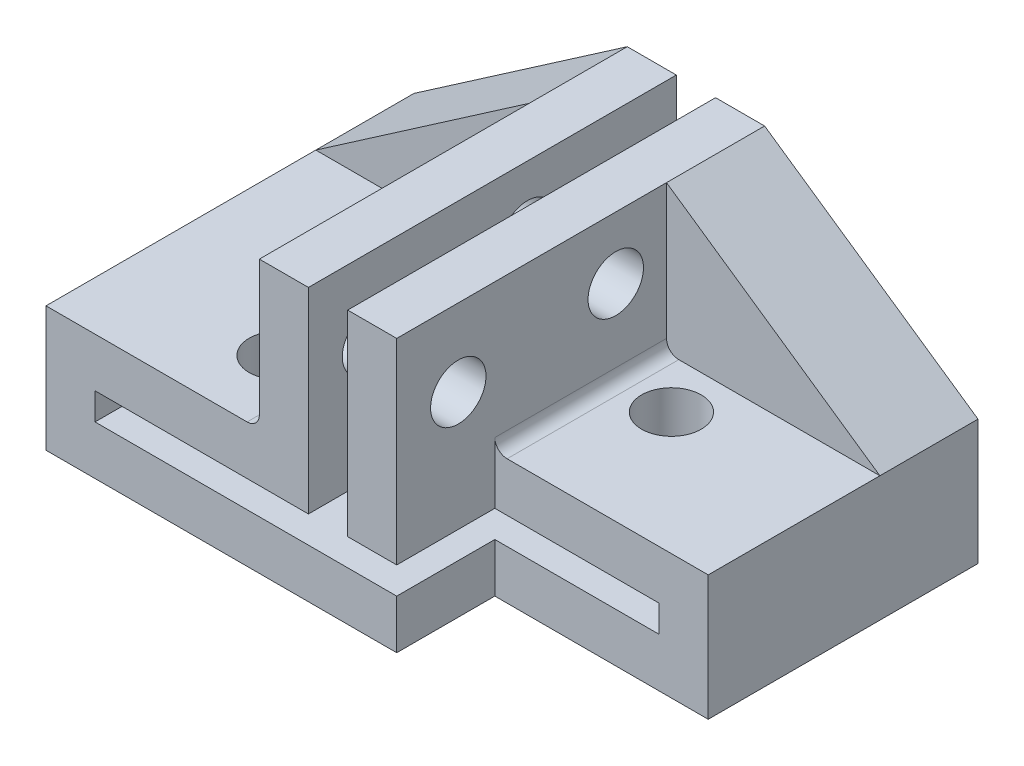
ISO-10303-21;
HEADER;
FILE_DESCRIPTION(('STEP AP214'),'2;1');
FILE_NAME('part.step','',(''),(''),'','','');
FILE_SCHEMA(('AUTOMOTIVE_DESIGN { 1 0 10303 214 1 1 1 1 }'));
ENDSEC;
DATA;
#1=APPLICATION_CONTEXT('core data for automotive mechanical design processes');
#2=APPLICATION_PROTOCOL_DEFINITION('international standard','automotive_design',2000,#1);
#3=PRODUCT_CONTEXT('',#1,'mechanical');
#4=PRODUCT('Part','Part','',(#3));
#5=PRODUCT_RELATED_PRODUCT_CATEGORY('part','',(#4));
#6=PRODUCT_DEFINITION_FORMATION('','',#4);
#7=PRODUCT_DEFINITION_CONTEXT('part definition',#1,'design');
#8=PRODUCT_DEFINITION('design','',#6,#7);
#9=PRODUCT_DEFINITION_SHAPE('','',#8);
#10=(LENGTH_UNIT() NAMED_UNIT(*) SI_UNIT(.MILLI.,.METRE.));
#11=(NAMED_UNIT(*) PLANE_ANGLE_UNIT() SI_UNIT($,.RADIAN.));
#12=(NAMED_UNIT(*) SI_UNIT($,.STERADIAN.) SOLID_ANGLE_UNIT());
#13=UNCERTAINTY_MEASURE_WITH_UNIT(LENGTH_MEASURE(1.E-05),#10,'distance_accuracy_value','');
#14=(GEOMETRIC_REPRESENTATION_CONTEXT(3) GLOBAL_UNCERTAINTY_ASSIGNED_CONTEXT((#13)) GLOBAL_UNIT_ASSIGNED_CONTEXT((#10,
#11,#12)) REPRESENTATION_CONTEXT('',''));
#15=CARTESIAN_POINT('',(0.,0.,0.));
#16=DIRECTION('',(0.,0.,1.));
#17=DIRECTION('',(1.,0.,0.));
#18=AXIS2_PLACEMENT_3D('',#15,#16,#17);
#19=CARTESIAN_POINT('',(14.3,-6.,15.));
#20=DIRECTION('',(0.,-1.,0.));
#21=DIRECTION('',(0.,0.,-1.));
#22=AXIS2_PLACEMENT_3D('',#19,#20,#21);
#23=PLANE('',#22);
#24=CARTESIAN_POINT('',(7.8,-6.,6.));
#25=DIRECTION('',(0.,1.,0.));
#26=DIRECTION('',(0.,0.,1.));
#27=AXIS2_PLACEMENT_3D('',#24,#25,#26);
#28=CIRCLE('',#27,1.215);
#29=CARTESIAN_POINT('',(7.8,-6.,7.215));
#30=VERTEX_POINT('',#29);
#31=EDGE_CURVE('E247',#30,#30,#28,.T.);
#32=ORIENTED_EDGE('',*,*,#31,.F.);
#33=EDGE_LOOP('',(#32));
#34=FACE_BOUND('',#33,.T.);
#35=DIRECTION('',(1.,0.,0.));
#36=VECTOR('',#35,1.);
#37=CARTESIAN_POINT('',(5.6,-6.,4.));
#38=LINE('',#37,#36);
#39=CARTESIAN_POINT('',(6.1,-6.,4.));
#40=VERTEX_POINT('',#39);
#41=CARTESIAN_POINT('',(14.3,-6.,4.));
#42=VERTEX_POINT('',#41);
#43=EDGE_CURVE('E449',#40,#42,#38,.T.);
#44=ORIENTED_EDGE('',*,*,#43,.F.);
#45=DIRECTION('',(0.,0.,-1.));
#46=VECTOR('',#45,1.);
#47=CARTESIAN_POINT('',(6.1,-6.,11.));
#48=LINE('',#47,#46);
#49=CARTESIAN_POINT('',(6.1,-6.,11.));
#50=VERTEX_POINT('',#49);
#51=EDGE_CURVE('E418',#40,#50,#48,.F.);
#52=ORIENTED_EDGE('',*,*,#51,.T.);
#53=DIRECTION('',(-1.,0.,0.));
#54=VECTOR('',#53,1.);
#55=CARTESIAN_POINT('',(14.3,-6.,11.));
#56=LINE('',#55,#54);
#57=CARTESIAN_POINT('',(14.3,-6.,11.));
#58=VERTEX_POINT('',#57);
#59=EDGE_CURVE('E287',#58,#50,#56,.T.);
#60=ORIENTED_EDGE('',*,*,#59,.F.);
#61=DIRECTION('',(0.,0.,-1.));
#62=VECTOR('',#61,1.);
#63=CARTESIAN_POINT('',(14.3,-6.,15.));
#64=LINE('',#63,#62);
#65=EDGE_CURVE('E388',#58,#42,#64,.T.);
#66=ORIENTED_EDGE('',*,*,#65,.T.);
#67=EDGE_LOOP('',(#44,#52,#60,#66));
#68=FACE_BOUND('',#67,.T.);
#69=ADVANCED_FACE('F39',(#34,#68),#23,.F.);
#70=CARTESIAN_POINT('',(5.6,-6.,15.));
#71=DIRECTION('',(-1.,0.,0.));
#72=DIRECTION('',(0.,-1.,0.));
#73=AXIS2_PLACEMENT_3D('',#70,#71,#72);
#74=PLANE('',#73);
#75=CARTESIAN_POINT('',(5.6,-2.53,6.06969452053169));
#76=DIRECTION('',(-1.,0.,0.));
#77=DIRECTION('',(0.,-1.,0.));
#78=AXIS2_PLACEMENT_3D('',#75,#76,#77);
#79=CIRCLE('',#78,1.1303);
#80=CARTESIAN_POINT('',(5.6,-3.6603,6.06969452053169));
#81=VERTEX_POINT('',#80);
#82=EDGE_CURVE('E284',#81,#81,#79,.T.);
#83=ORIENTED_EDGE('',*,*,#82,.T.);
#84=EDGE_LOOP('',(#83));
#85=FACE_BOUND('',#84,.T.);
#86=CARTESIAN_POINT('',(5.6,-3.1482051037554,12.49));
#87=DIRECTION('',(-1.,0.,0.));
#88=DIRECTION('',(0.,-1.,0.));
#89=AXIS2_PLACEMENT_3D('',#86,#87,#88);
#90=CIRCLE('',#89,1.1303);
#91=CARTESIAN_POINT('',(5.6,-4.2785051037554,12.49));
#92=VERTEX_POINT('',#91);
#93=EDGE_CURVE('E274',#92,#92,#90,.T.);
#94=ORIENTED_EDGE('',*,*,#93,.T.);
#95=EDGE_LOOP('',(#94));
#96=FACE_BOUND('',#95,.T.);
#97=DIRECTION('',(0.,1.,0.));
#98=VECTOR('',#97,1.);
#99=CARTESIAN_POINT('',(5.6,-21.,11.));
#100=LINE('',#99,#98);
#101=CARTESIAN_POINT('',(5.6,-8.,11.));
#102=VERTEX_POINT('',#101);
#103=CARTESIAN_POINT('',(5.6,-5.5,11.));
#104=VERTEX_POINT('',#103);
#105=EDGE_CURVE('E291',#102,#104,#100,.T.);
#106=ORIENTED_EDGE('',*,*,#105,.T.);
#107=DIRECTION('',(0.,0.,-1.));
#108=VECTOR('',#107,1.);
#109=CARTESIAN_POINT('',(5.6,-5.5,4.));
#110=LINE('',#109,#108);
#111=CARTESIAN_POINT('',(5.6,-5.5,4.));
#112=VERTEX_POINT('',#111);
#113=EDGE_CURVE('E403',#104,#112,#110,.T.);
#114=ORIENTED_EDGE('',*,*,#113,.T.);
#115=DIRECTION('',(0.,-1.,0.));
#116=VECTOR('',#115,1.);
#117=CARTESIAN_POINT('',(5.6,0.,4.));
#118=LINE('',#117,#116);
#119=CARTESIAN_POINT('',(5.6,0.,4.));
#120=VERTEX_POINT('',#119);
#121=EDGE_CURVE('E439',#120,#112,#118,.T.);
#122=ORIENTED_EDGE('',*,*,#121,.F.);
#123=DIRECTION('',(0.,0.,-1.));
#124=VECTOR('',#123,1.);
#125=CARTESIAN_POINT('',(5.6,0.,15.));
#126=LINE('',#125,#124);
#127=CARTESIAN_POINT('',(5.6,0.,15.));
#128=VERTEX_POINT('',#127);
#129=EDGE_CURVE('E385',#128,#120,#126,.T.);
#130=ORIENTED_EDGE('',*,*,#129,.F.);
#131=DIRECTION('',(0.,1.,0.));
#132=VECTOR('',#131,1.);
#133=CARTESIAN_POINT('',(5.6,-6.,15.));
#134=LINE('',#133,#132);
#135=CARTESIAN_POINT('',(5.6,-8.,15.));
#136=VERTEX_POINT('',#135);
#137=EDGE_CURVE('E322',#136,#128,#134,.T.);
#138=ORIENTED_EDGE('',*,*,#137,.F.);
#139=DIRECTION('',(0.,0.,-1.));
#140=VECTOR('',#139,1.);
#141=CARTESIAN_POINT('',(5.6,-8.,15.));
#142=LINE('',#141,#140);
#143=EDGE_CURVE('E297',#136,#102,#142,.T.);
#144=ORIENTED_EDGE('',*,*,#143,.T.);
#145=EDGE_LOOP('',(#106,#114,#122,#130,#138,#144));
#146=FACE_BOUND('',#145,.T.);
#147=ADVANCED_FACE('F437',(#85,#96,#146),#74,.F.);
#148=CARTESIAN_POINT('',(0.,0.,15.));
#149=DIRECTION('',(1.,0.,0.));
#150=DIRECTION('',(0.,1.,0.));
#151=AXIS2_PLACEMENT_3D('',#148,#149,#150);
#152=PLANE('',#151);
#153=CARTESIAN_POINT('',(0.,-2.53,6.06969452053169));
#154=DIRECTION('',(-1.,0.,0.));
#155=DIRECTION('',(0.,-1.,0.));
#156=AXIS2_PLACEMENT_3D('',#153,#154,#155);
#157=CIRCLE('',#156,1.1303);
#158=CARTESIAN_POINT('',(0.,-3.6603,6.06969452053169));
#159=VERTEX_POINT('',#158);
#160=EDGE_CURVE('E277',#159,#159,#157,.T.);
#161=ORIENTED_EDGE('',*,*,#160,.F.);
#162=EDGE_LOOP('',(#161));
#163=FACE_BOUND('',#162,.T.);
#164=CARTESIAN_POINT('',(0.,-3.1482051037554,12.49));
#165=DIRECTION('',(-1.,0.,0.));
#166=DIRECTION('',(0.,-1.,0.));
#167=AXIS2_PLACEMENT_3D('',#164,#165,#166);
#168=CIRCLE('',#167,1.1303);
#169=CARTESIAN_POINT('',(0.,-4.2785051037554,12.49));
#170=VERTEX_POINT('',#169);
#171=EDGE_CURVE('E267',#170,#170,#168,.T.);
#172=ORIENTED_EDGE('',*,*,#171,.F.);
#173=EDGE_LOOP('',(#172));
#174=FACE_BOUND('',#173,.T.);
#175=DIRECTION('',(0.,-1.,0.));
#176=VECTOR('',#175,1.);
#177=CARTESIAN_POINT('',(0.,0.,4.));
#178=LINE('',#177,#176);
#179=CARTESIAN_POINT('',(0.,0.,4.));
#180=VERTEX_POINT('',#179);
#181=CARTESIAN_POINT('',(0.,-5.5,4.));
#182=VERTEX_POINT('',#181);
#183=EDGE_CURVE('E224',#180,#182,#178,.T.);
#184=ORIENTED_EDGE('',*,*,#183,.T.);
#185=DIRECTION('',(0.,0.,-1.));
#186=VECTOR('',#185,1.);
#187=CARTESIAN_POINT('',(0.,-5.5,15.));
#188=LINE('',#187,#186);
#189=CARTESIAN_POINT('',(0.,-5.5,15.));
#190=VERTEX_POINT('',#189);
#191=EDGE_CURVE('E54',#182,#190,#188,.F.);
#192=ORIENTED_EDGE('',*,*,#191,.T.);
#193=DIRECTION('',(0.,-1.,0.));
#194=VECTOR('',#193,1.);
#195=CARTESIAN_POINT('',(0.,0.,15.));
#196=LINE('',#195,#194);
#197=CARTESIAN_POINT('',(0.,0.,15.));
#198=VERTEX_POINT('',#197);
#199=EDGE_CURVE('E312',#198,#190,#196,.T.);
#200=ORIENTED_EDGE('',*,*,#199,.F.);
#201=DIRECTION('',(0.,0.,-1.));
#202=VECTOR('',#201,1.);
#203=CARTESIAN_POINT('',(0.,0.,15.));
#204=LINE('',#203,#202);
#205=EDGE_CURVE('E396',#198,#180,#204,.T.);
#206=ORIENTED_EDGE('',*,*,#205,.T.);
#207=EDGE_LOOP('',(#184,#192,#200,#206));
#208=FACE_BOUND('',#207,.T.);
#209=ADVANCED_FACE('F474',(#163,#174,#208),#152,.F.);
#210=CARTESIAN_POINT('',(0.,-6.,15.));
#211=DIRECTION('',(0.,-1.,0.));
#212=DIRECTION('',(1.,0.,0.));
#213=AXIS2_PLACEMENT_3D('',#210,#211,#212);
#214=PLANE('',#213);
#215=CARTESIAN_POINT('',(-2.2,-6.,12.));
#216=DIRECTION('',(0.,1.,0.));
#217=DIRECTION('',(0.,0.,1.));
#218=AXIS2_PLACEMENT_3D('',#215,#216,#217);
#219=CIRCLE('',#218,1.215);
#220=CARTESIAN_POINT('',(-2.2,-6.,13.215));
#221=VERTEX_POINT('',#220);
#222=EDGE_CURVE('E257',#221,#221,#219,.T.);
#223=ORIENTED_EDGE('',*,*,#222,.F.);
#224=EDGE_LOOP('',(#223));
#225=FACE_BOUND('',#224,.T.);
#226=CARTESIAN_POINT('',(-2.2,-6.,6.));
#227=DIRECTION('',(0.,1.,0.));
#228=DIRECTION('',(0.,0.,1.));
#229=AXIS2_PLACEMENT_3D('',#226,#227,#228);
#230=CIRCLE('',#229,1.215);
#231=CARTESIAN_POINT('',(-2.2,-6.,7.215));
#232=VERTEX_POINT('',#231);
#233=EDGE_CURVE('E236',#232,#232,#230,.T.);
#234=ORIENTED_EDGE('',*,*,#233,.F.);
#235=EDGE_LOOP('',(#234));
#236=FACE_BOUND('',#235,.T.);
#237=DIRECTION('',(-1.,0.,0.));
#238=VECTOR('',#237,1.);
#239=CARTESIAN_POINT('',(0.,-6.,15.));
#240=LINE('',#239,#238);
#241=CARTESIAN_POINT('',(-0.499999999999999,-6.,15.));
#242=VERTEX_POINT('',#241);
#243=CARTESIAN_POINT('',(-8.7,-6.,15.));
#244=VERTEX_POINT('',#243);
#245=EDGE_CURVE('E315',#242,#244,#240,.T.);
#246=ORIENTED_EDGE('',*,*,#245,.F.);
#247=DIRECTION('',(0.,0.,-1.));
#248=VECTOR('',#247,1.);
#249=CARTESIAN_POINT('',(-0.499999999999999,-6.,4.));
#250=LINE('',#249,#248);
#251=CARTESIAN_POINT('',(-0.499999999999999,-6.,4.));
#252=VERTEX_POINT('',#251);
#253=EDGE_CURVE('E420',#242,#252,#250,.T.);
#254=ORIENTED_EDGE('',*,*,#253,.T.);
#255=DIRECTION('',(-1.,0.,0.));
#256=VECTOR('',#255,1.);
#257=CARTESIAN_POINT('',(0.,-6.,4.));
#258=LINE('',#257,#256);
#259=CARTESIAN_POINT('',(-8.7,-6.,4.));
#260=VERTEX_POINT('',#259);
#261=EDGE_CURVE('E227',#252,#260,#258,.T.);
#262=ORIENTED_EDGE('',*,*,#261,.T.);
#263=DIRECTION('',(0.,0.,-1.));
#264=VECTOR('',#263,1.);
#265=CARTESIAN_POINT('',(-8.7,-6.,15.));
#266=LINE('',#265,#264);
#267=EDGE_CURVE('E215',#244,#260,#266,.T.);
#268=ORIENTED_EDGE('',*,*,#267,.F.);
#269=EDGE_LOOP('',(#246,#254,#262,#268));
#270=FACE_BOUND('',#269,.T.);
#271=ADVANCED_FACE('F489',(#225,#236,#270),#214,.F.);
#272=CARTESIAN_POINT('',(0.,0.,15.));
#273=DIRECTION('',(0.,0.,1.));
#274=DIRECTION('',(1.,0.,0.));
#275=AXIS2_PLACEMENT_3D('',#272,#273,#274);
#276=PLANE('',#275);
#277=DIRECTION('',(-1.,0.,0.));
#278=VECTOR('',#277,1.);
#279=CARTESIAN_POINT('',(12.3,-8.,15.));
#280=LINE('',#279,#278);
#281=CARTESIAN_POINT('',(3.6,-8.,15.));
#282=VERTEX_POINT('',#281);
#283=EDGE_CURVE('E329',#136,#282,#280,.T.);
#284=ORIENTED_EDGE('',*,*,#283,.F.);
#285=ORIENTED_EDGE('',*,*,#137,.T.);
#286=DIRECTION('',(-1.,0.,0.));
#287=VECTOR('',#286,1.);
#288=CARTESIAN_POINT('',(5.6,0.,15.));
#289=LINE('',#288,#287);
#290=CARTESIAN_POINT('',(3.6,0.,15.));
#291=VERTEX_POINT('',#290);
#292=EDGE_CURVE('E324',#128,#291,#289,.T.);
#293=ORIENTED_EDGE('',*,*,#292,.T.);
#294=DIRECTION('',(0.,1.,0.));
#295=VECTOR('',#294,1.);
#296=CARTESIAN_POINT('',(3.6,-3.54106484325997,15.));
#297=LINE('',#296,#295);
#298=EDGE_CURVE('E326',#282,#291,#297,.T.);
#299=ORIENTED_EDGE('',*,*,#298,.F.);
#300=EDGE_LOOP('',(#284,#285,#293,#299));
#301=FACE_BOUND('',#300,.T.);
#302=ADVANCED_FACE('F492',(#301),#276,.T.);
#303=CARTESIAN_POINT('',(2.,0.,15.));
#304=DIRECTION('',(0.,-1.,0.));
#305=DIRECTION('',(1.,0.,0.));
#306=AXIS2_PLACEMENT_3D('',#303,#304,#305);
#307=PLANE('',#306);
#308=DIRECTION('',(-1.,0.,0.));
#309=VECTOR('',#308,1.);
#310=CARTESIAN_POINT('',(2.,0.,0.));
#311=LINE('',#310,#309);
#312=CARTESIAN_POINT('',(2.,0.,0.));
#313=VERTEX_POINT('',#312);
#314=CARTESIAN_POINT('',(0.,0.,0.));
#315=VERTEX_POINT('',#314);
#316=EDGE_CURVE('E207',#313,#315,#311,.T.);
#317=ORIENTED_EDGE('',*,*,#316,.T.);
#318=DIRECTION('',(0.,0.,-1.));
#319=VECTOR('',#318,1.);
#320=CARTESIAN_POINT('',(0.,0.,4.));
#321=LINE('',#320,#319);
#322=EDGE_CURVE('E219',#180,#315,#321,.T.);
#323=ORIENTED_EDGE('',*,*,#322,.F.);
#324=ORIENTED_EDGE('',*,*,#205,.F.);
#325=DIRECTION('',(-1.,0.,0.));
#326=VECTOR('',#325,1.);
#327=CARTESIAN_POINT('',(2.,0.,15.));
#328=LINE('',#327,#326);
#329=CARTESIAN_POINT('',(2.,0.,15.));
#330=VERTEX_POINT('',#329);
#331=EDGE_CURVE('E309',#330,#198,#328,.T.);
#332=ORIENTED_EDGE('',*,*,#331,.F.);
#333=DIRECTION('',(0.,0.,-1.));
#334=VECTOR('',#333,1.);
#335=CARTESIAN_POINT('',(2.,0.,15.));
#336=LINE('',#335,#334);
#337=EDGE_CURVE('E342',#330,#313,#336,.T.);
#338=ORIENTED_EDGE('',*,*,#337,.T.);
#339=EDGE_LOOP('',(#317,#323,#324,#332,#338));
#340=FACE_BOUND('',#339,.T.);
#341=ADVANCED_FACE('F488',(#340),#307,.F.);
#342=CARTESIAN_POINT('',(-8.7,-6.,15.));
#343=DIRECTION('',(1.,0.,0.));
#344=DIRECTION('',(0.,0.,-1.));
#345=AXIS2_PLACEMENT_3D('',#342,#343,#344);
#346=PLANE('',#345);
#347=DIRECTION('',(0.,-1.,0.));
#348=VECTOR('',#347,1.);
#349=CARTESIAN_POINT('',(-8.7,-6.,0.));
#350=LINE('',#349,#348);
#351=CARTESIAN_POINT('',(-8.7,-6.,0.));
#352=VERTEX_POINT('',#351);
#353=CARTESIAN_POINT('',(-8.7,-11.1,0.));
#354=VERTEX_POINT('',#353);
#355=EDGE_CURVE('E194',#352,#354,#350,.T.);
#356=ORIENTED_EDGE('',*,*,#355,.T.);
#357=DIRECTION('',(0.,0.,-1.));
#358=VECTOR('',#357,1.);
#359=CARTESIAN_POINT('',(-8.7,-11.1,15.));
#360=LINE('',#359,#358);
#361=CARTESIAN_POINT('',(-8.7,-11.1,15.));
#362=VERTEX_POINT('',#361);
#363=EDGE_CURVE('E393',#362,#354,#360,.T.);
#364=ORIENTED_EDGE('',*,*,#363,.F.);
#365=DIRECTION('',(0.,-1.,0.));
#366=VECTOR('',#365,1.);
#367=CARTESIAN_POINT('',(-8.7,-6.,15.));
#368=LINE('',#367,#366);
#369=EDGE_CURVE('E317',#244,#362,#368,.T.);
#370=ORIENTED_EDGE('',*,*,#369,.F.);
#371=ORIENTED_EDGE('',*,*,#267,.T.);
#372=DIRECTION('',(0.,0.,-1.));
#373=VECTOR('',#372,1.);
#374=CARTESIAN_POINT('',(-8.7,-6.,4.));
#375=LINE('',#374,#373);
#376=EDGE_CURVE('E211',#260,#352,#375,.T.);
#377=ORIENTED_EDGE('',*,*,#376,.T.);
#378=EDGE_LOOP('',(#356,#364,#370,#371,#377));
#379=FACE_BOUND('',#378,.T.);
#380=ADVANCED_FACE('F212',(#379),#346,.F.);
#381=CARTESIAN_POINT('',(-8.7,-11.1,15.));
#382=DIRECTION('',(0.,1.,0.));
#383=DIRECTION('',(0.,0.,1.));
#384=AXIS2_PLACEMENT_3D('',#381,#382,#383);
#385=PLANE('',#384);
#386=CARTESIAN_POINT('',(-2.2,-11.1,6.));
#387=DIRECTION('',(0.,1.,0.));
#388=DIRECTION('',(0.,0.,1.));
#389=AXIS2_PLACEMENT_3D('',#386,#387,#388);
#390=CIRCLE('',#389,1.215);
#391=CARTESIAN_POINT('',(-2.2,-11.1,7.215));
#392=VERTEX_POINT('',#391);
#393=EDGE_CURVE('E244',#392,#392,#390,.T.);
#394=ORIENTED_EDGE('',*,*,#393,.T.);
#395=EDGE_LOOP('',(#394));
#396=FACE_BOUND('',#395,.T.);
#397=CARTESIAN_POINT('',(7.8,-11.1,6.));
#398=DIRECTION('',(0.,1.,0.));
#399=DIRECTION('',(0.,0.,1.));
#400=AXIS2_PLACEMENT_3D('',#397,#398,#399);
#401=CIRCLE('',#400,1.215);
#402=CARTESIAN_POINT('',(7.8,-11.1,7.215));
#403=VERTEX_POINT('',#402);
#404=EDGE_CURVE('E254',#403,#403,#401,.T.);
#405=ORIENTED_EDGE('',*,*,#404,.T.);
#406=EDGE_LOOP('',(#405));
#407=FACE_BOUND('',#406,.T.);
#408=CARTESIAN_POINT('',(-2.2,-11.1,12.));
#409=DIRECTION('',(0.,1.,0.));
#410=DIRECTION('',(0.,0.,1.));
#411=AXIS2_PLACEMENT_3D('',#408,#409,#410);
#412=CIRCLE('',#411,1.215);
#413=CARTESIAN_POINT('',(-2.2,-11.1,13.215));
#414=VERTEX_POINT('',#413);
#415=EDGE_CURVE('E264',#414,#414,#412,.T.);
#416=ORIENTED_EDGE('',*,*,#415,.T.);
#417=EDGE_LOOP('',(#416));
#418=FACE_BOUND('',#417,.T.);
#419=DIRECTION('',(-1.,0.,0.));
#420=VECTOR('',#419,1.);
#421=CARTESIAN_POINT('',(-8.7,-11.1,11.));
#422=LINE('',#421,#420);
#423=CARTESIAN_POINT('',(14.3,-11.1,11.));
#424=VERTEX_POINT('',#423);
#425=CARTESIAN_POINT('',(5.6,-11.1,11.));
#426=VERTEX_POINT('',#425);
#427=EDGE_CURVE('E306',#424,#426,#422,.T.);
#428=ORIENTED_EDGE('',*,*,#427,.T.);
#429=DIRECTION('',(0.,0.,1.));
#430=VECTOR('',#429,1.);
#431=CARTESIAN_POINT('',(5.6,-11.1,15.));
#432=LINE('',#431,#430);
#433=CARTESIAN_POINT('',(5.6,-11.1,15.));
#434=VERTEX_POINT('',#433);
#435=EDGE_CURVE('E299',#426,#434,#432,.T.);
#436=ORIENTED_EDGE('',*,*,#435,.T.);
#437=DIRECTION('',(1.,0.,0.));
#438=VECTOR('',#437,1.);
#439=CARTESIAN_POINT('',(-8.7,-11.1,15.));
#440=LINE('',#439,#438);
#441=EDGE_CURVE('E319',#362,#434,#440,.T.);
#442=ORIENTED_EDGE('',*,*,#441,.F.);
#443=ORIENTED_EDGE('',*,*,#363,.T.);
#444=DIRECTION('',(1.,0.,0.));
#445=VECTOR('',#444,1.);
#446=CARTESIAN_POINT('',(-8.7,-11.1,0.));
#447=LINE('',#446,#445);
#448=CARTESIAN_POINT('',(14.3,-11.1,0.));
#449=VERTEX_POINT('',#448);
#450=EDGE_CURVE('E203',#354,#449,#447,.T.);
#451=ORIENTED_EDGE('',*,*,#450,.T.);
#452=DIRECTION('',(0.,0.,-1.));
#453=VECTOR('',#452,1.);
#454=CARTESIAN_POINT('',(14.3,-11.1,15.));
#455=LINE('',#454,#453);
#456=EDGE_CURVE('E391',#424,#449,#455,.T.);
#457=ORIENTED_EDGE('',*,*,#456,.F.);
#458=EDGE_LOOP('',(#428,#436,#442,#443,#451,#457));
#459=FACE_BOUND('',#458,.T.);
#460=ADVANCED_FACE('F482',(#396,#407,#418,#459),#385,.F.);
#461=CARTESIAN_POINT('',(14.3,-11.1,15.));
#462=DIRECTION('',(-1.,0.,0.));
#463=DIRECTION('',(0.,0.,1.));
#464=AXIS2_PLACEMENT_3D('',#461,#462,#463);
#465=PLANE('',#464);
#466=ORIENTED_EDGE('',*,*,#65,.F.);
#467=DIRECTION('',(0.,1.,0.));
#468=VECTOR('',#467,1.);
#469=CARTESIAN_POINT('',(14.3,-21.,11.));
#470=LINE('',#469,#468);
#471=EDGE_CURVE('E290',#424,#58,#470,.T.);
#472=ORIENTED_EDGE('',*,*,#471,.F.);
#473=ORIENTED_EDGE('',*,*,#456,.T.);
#474=DIRECTION('',(0.,1.,0.));
#475=VECTOR('',#474,1.);
#476=CARTESIAN_POINT('',(14.3,-11.1,0.));
#477=LINE('',#476,#475);
#478=CARTESIAN_POINT('',(14.3,-6.,0.));
#479=VERTEX_POINT('',#478);
#480=EDGE_CURVE('E345',#449,#479,#477,.T.);
#481=ORIENTED_EDGE('',*,*,#480,.T.);
#482=DIRECTION('',(0.,0.,-1.));
#483=VECTOR('',#482,1.);
#484=CARTESIAN_POINT('',(14.3,-6.00000000000001,4.));
#485=LINE('',#484,#483);
#486=EDGE_CURVE('E225',#42,#479,#485,.T.);
#487=ORIENTED_EDGE('',*,*,#486,.F.);
#488=EDGE_LOOP('',(#466,#472,#473,#481,#487));
#489=FACE_BOUND('',#488,.T.);
#490=ADVANCED_FACE('F465',(#489),#465,.F.);
#491=CARTESIAN_POINT('',(5.6,0.,15.));
#492=DIRECTION('',(0.,-1.,0.));
#493=DIRECTION('',(1.,0.,0.));
#494=AXIS2_PLACEMENT_3D('',#491,#492,#493);
#495=PLANE('',#494);
#496=DIRECTION('',(-1.,0.,0.));
#497=VECTOR('',#496,1.);
#498=CARTESIAN_POINT('',(5.6,0.,0.));
#499=LINE('',#498,#497);
#500=CARTESIAN_POINT('',(5.6,0.,0.));
#501=VERTEX_POINT('',#500);
#502=CARTESIAN_POINT('',(3.6,0.,0.));
#503=VERTEX_POINT('',#502);
#504=EDGE_CURVE('E347',#501,#503,#499,.T.);
#505=ORIENTED_EDGE('',*,*,#504,.T.);
#506=DIRECTION('',(0.,0.,-1.));
#507=VECTOR('',#506,1.);
#508=CARTESIAN_POINT('',(3.6,0.,15.));
#509=LINE('',#508,#507);
#510=EDGE_CURVE('E382',#291,#503,#509,.T.);
#511=ORIENTED_EDGE('',*,*,#510,.F.);
#512=ORIENTED_EDGE('',*,*,#292,.F.);
#513=ORIENTED_EDGE('',*,*,#129,.T.);
#514=DIRECTION('',(0.,0.,-1.));
#515=VECTOR('',#514,1.);
#516=CARTESIAN_POINT('',(5.6,0.,4.));
#517=LINE('',#516,#515);
#518=EDGE_CURVE('E230',#120,#501,#517,.T.);
#519=ORIENTED_EDGE('',*,*,#518,.T.);
#520=EDGE_LOOP('',(#505,#511,#512,#513,#519));
#521=FACE_BOUND('',#520,.T.);
#522=ADVANCED_FACE('F456',(#521),#495,.F.);
#523=CARTESIAN_POINT('',(3.6,-8.,15.));
#524=DIRECTION('',(-1.,0.,0.));
#525=DIRECTION('',(0.,0.,1.));
#526=AXIS2_PLACEMENT_3D('',#523,#524,#525);
#527=PLANE('',#526);
#528=CARTESIAN_POINT('',(3.6,-3.1482051037554,12.49));
#529=DIRECTION('',(-1.,0.,0.));
#530=DIRECTION('',(0.,0.,1.));
#531=AXIS2_PLACEMENT_3D('',#528,#529,#530);
#532=CIRCLE('',#531,1.1303);
#533=CARTESIAN_POINT('',(3.6,-3.1482051037554,13.6203));
#534=VERTEX_POINT('',#533);
#535=EDGE_CURVE('E271',#534,#534,#532,.T.);
#536=ORIENTED_EDGE('',*,*,#535,.F.);
#537=EDGE_LOOP('',(#536));
#538=FACE_BOUND('',#537,.T.);
#539=CARTESIAN_POINT('',(3.6,-2.53,6.06969452053169));
#540=DIRECTION('',(-1.,0.,0.));
#541=DIRECTION('',(0.,0.,1.));
#542=AXIS2_PLACEMENT_3D('',#539,#540,#541);
#543=CIRCLE('',#542,1.1303);
#544=CARTESIAN_POINT('',(3.6,-2.53,7.19999452053169));
#545=VERTEX_POINT('',#544);
#546=EDGE_CURVE('E281',#545,#545,#543,.T.);
#547=ORIENTED_EDGE('',*,*,#546,.F.);
#548=EDGE_LOOP('',(#547));
#549=FACE_BOUND('',#548,.T.);
#550=DIRECTION('',(0.,1.,0.));
#551=VECTOR('',#550,1.);
#552=CARTESIAN_POINT('',(3.6,-8.,0.));
#553=LINE('',#552,#551);
#554=CARTESIAN_POINT('',(3.6,-8.,0.));
#555=VERTEX_POINT('',#554);
#556=EDGE_CURVE('E350',#555,#503,#553,.T.);
#557=ORIENTED_EDGE('',*,*,#556,.F.);
#558=DIRECTION('',(0.,0.,-1.));
#559=VECTOR('',#558,1.);
#560=CARTESIAN_POINT('',(3.6,-8.,15.));
#561=LINE('',#560,#559);
#562=EDGE_CURVE('E380',#282,#555,#561,.T.);
#563=ORIENTED_EDGE('',*,*,#562,.F.);
#564=ORIENTED_EDGE('',*,*,#298,.T.);
#565=ORIENTED_EDGE('',*,*,#510,.T.);
#566=EDGE_LOOP('',(#557,#563,#564,#565));
#567=FACE_BOUND('',#566,.T.);
#568=ADVANCED_FACE('F576',(#538,#549,#567),#527,.T.);
#569=CARTESIAN_POINT('',(12.3,-8.,15.));
#570=DIRECTION('',(0.,-1.,0.));
#571=DIRECTION('',(0.,0.,-1.));
#572=AXIS2_PLACEMENT_3D('',#569,#570,#571);
#573=PLANE('',#572);
#574=CARTESIAN_POINT('',(7.8,-8.,6.));
#575=DIRECTION('',(0.,-1.,0.));
#576=DIRECTION('',(0.,0.,-1.));
#577=AXIS2_PLACEMENT_3D('',#574,#575,#576);
#578=CIRCLE('',#577,1.215);
#579=CARTESIAN_POINT('',(7.8,-8.,4.785));
#580=VERTEX_POINT('',#579);
#581=EDGE_CURVE('E251',#580,#580,#578,.T.);
#582=ORIENTED_EDGE('',*,*,#581,.F.);
#583=EDGE_LOOP('',(#582));
#584=FACE_BOUND('',#583,.T.);
#585=ORIENTED_EDGE('',*,*,#143,.F.);
#586=ORIENTED_EDGE('',*,*,#283,.T.);
#587=ORIENTED_EDGE('',*,*,#562,.T.);
#588=DIRECTION('',(-1.,0.,0.));
#589=VECTOR('',#588,1.);
#590=CARTESIAN_POINT('',(12.3,-8.,0.));
#591=LINE('',#590,#589);
#592=CARTESIAN_POINT('',(12.3,-8.,0.));
#593=VERTEX_POINT('',#592);
#594=EDGE_CURVE('E352',#593,#555,#591,.T.);
#595=ORIENTED_EDGE('',*,*,#594,.F.);
#596=DIRECTION('',(0.,0.,-1.));
#597=VECTOR('',#596,1.);
#598=CARTESIAN_POINT('',(12.3,-8.,15.));
#599=LINE('',#598,#597);
#600=CARTESIAN_POINT('',(12.3,-8.,11.));
#601=VERTEX_POINT('',#600);
#602=EDGE_CURVE('E378',#601,#593,#599,.T.);
#603=ORIENTED_EDGE('',*,*,#602,.F.);
#604=DIRECTION('',(1.,0.,0.));
#605=VECTOR('',#604,1.);
#606=CARTESIAN_POINT('',(12.3,-8.,11.));
#607=LINE('',#606,#605);
#608=EDGE_CURVE('E304',#102,#601,#607,.T.);
#609=ORIENTED_EDGE('',*,*,#608,.F.);
#610=EDGE_LOOP('',(#585,#586,#587,#595,#603,#609));
#611=FACE_BOUND('',#610,.T.);
#612=ADVANCED_FACE('F572',(#584,#611),#573,.T.);
#613=CARTESIAN_POINT('',(12.3,-9.1,15.));
#614=DIRECTION('',(-1.,0.,0.));
#615=DIRECTION('',(0.,0.,1.));
#616=AXIS2_PLACEMENT_3D('',#613,#614,#615);
#617=PLANE('',#616);
#618=DIRECTION('',(0.,-1.,0.));
#619=VECTOR('',#618,1.);
#620=CARTESIAN_POINT('',(12.3,-9.1,11.));
#621=LINE('',#620,#619);
#622=CARTESIAN_POINT('',(12.3,-9.1,11.));
#623=VERTEX_POINT('',#622);
#624=EDGE_CURVE('E302',#601,#623,#621,.T.);
#625=ORIENTED_EDGE('',*,*,#624,.F.);
#626=ORIENTED_EDGE('',*,*,#602,.T.);
#627=DIRECTION('',(0.,1.,0.));
#628=VECTOR('',#627,1.);
#629=CARTESIAN_POINT('',(12.3,-9.1,0.));
#630=LINE('',#629,#628);
#631=CARTESIAN_POINT('',(12.3,-9.1,0.));
#632=VERTEX_POINT('',#631);
#633=EDGE_CURVE('E355',#632,#593,#630,.T.);
#634=ORIENTED_EDGE('',*,*,#633,.F.);
#635=DIRECTION('',(0.,0.,-1.));
#636=VECTOR('',#635,1.);
#637=CARTESIAN_POINT('',(12.3,-9.1,15.));
#638=LINE('',#637,#636);
#639=EDGE_CURVE('E376',#623,#632,#638,.T.);
#640=ORIENTED_EDGE('',*,*,#639,.F.);
#641=EDGE_LOOP('',(#625,#626,#634,#640));
#642=FACE_BOUND('',#641,.T.);
#643=ADVANCED_FACE('F568',(#642),#617,.T.);
#644=CARTESIAN_POINT('',(-6.7,-9.1,15.));
#645=DIRECTION('',(0.,1.,0.));
#646=DIRECTION('',(0.,0.,1.));
#647=AXIS2_PLACEMENT_3D('',#644,#645,#646);
#648=PLANE('',#647);
#649=CARTESIAN_POINT('',(-2.2,-9.1,6.));
#650=DIRECTION('',(0.,1.,0.));
#651=DIRECTION('',(0.,0.,1.));
#652=AXIS2_PLACEMENT_3D('',#649,#650,#651);
#653=CIRCLE('',#652,1.215);
#654=CARTESIAN_POINT('',(-2.2,-9.1,7.215));
#655=VERTEX_POINT('',#654);
#656=EDGE_CURVE('E241',#655,#655,#653,.T.);
#657=ORIENTED_EDGE('',*,*,#656,.F.);
#658=EDGE_LOOP('',(#657));
#659=FACE_BOUND('',#658,.T.);
#660=CARTESIAN_POINT('',(7.8,-9.1,6.));
#661=DIRECTION('',(0.,1.,0.));
#662=DIRECTION('',(0.,0.,1.));
#663=AXIS2_PLACEMENT_3D('',#660,#661,#662);
#664=CIRCLE('',#663,1.215);
#665=CARTESIAN_POINT('',(7.8,-9.1,7.215));
#666=VERTEX_POINT('',#665);
#667=EDGE_CURVE('E250',#666,#666,#664,.T.);
#668=ORIENTED_EDGE('',*,*,#667,.F.);
#669=EDGE_LOOP('',(#668));
#670=FACE_BOUND('',#669,.T.);
#671=CARTESIAN_POINT('',(-2.2,-9.1,12.));
#672=DIRECTION('',(0.,1.,0.));
#673=DIRECTION('',(0.,0.,1.));
#674=AXIS2_PLACEMENT_3D('',#671,#672,#673);
#675=CIRCLE('',#674,1.215);
#676=CARTESIAN_POINT('',(-2.2,-9.1,13.215));
#677=VERTEX_POINT('',#676);
#678=EDGE_CURVE('E261',#677,#677,#675,.T.);
#679=ORIENTED_EDGE('',*,*,#678,.F.);
#680=EDGE_LOOP('',(#679));
#681=FACE_BOUND('',#680,.T.);
#682=DIRECTION('',(0.,0.,1.));
#683=VECTOR('',#682,1.);
#684=CARTESIAN_POINT('',(5.6,-9.1,15.));
#685=LINE('',#684,#683);
#686=CARTESIAN_POINT('',(5.6,-9.1,11.));
#687=VERTEX_POINT('',#686);
#688=CARTESIAN_POINT('',(5.6,-9.1,15.));
#689=VERTEX_POINT('',#688);
#690=EDGE_CURVE('E295',#687,#689,#685,.T.);
#691=ORIENTED_EDGE('',*,*,#690,.F.);
#692=DIRECTION('',(-1.,0.,0.));
#693=VECTOR('',#692,1.);
#694=CARTESIAN_POINT('',(-6.7,-9.1,11.));
#695=LINE('',#694,#693);
#696=EDGE_CURVE('E401',#623,#687,#695,.T.);
#697=ORIENTED_EDGE('',*,*,#696,.F.);
#698=ORIENTED_EDGE('',*,*,#639,.T.);
#699=DIRECTION('',(1.,0.,0.));
#700=VECTOR('',#699,1.);
#701=CARTESIAN_POINT('',(-6.7,-9.1,0.));
#702=LINE('',#701,#700);
#703=CARTESIAN_POINT('',(-6.7,-9.1,0.));
#704=VERTEX_POINT('',#703);
#705=EDGE_CURVE('E358',#704,#632,#702,.T.);
#706=ORIENTED_EDGE('',*,*,#705,.F.);
#707=DIRECTION('',(0.,0.,-1.));
#708=VECTOR('',#707,1.);
#709=CARTESIAN_POINT('',(-6.7,-9.1,15.));
#710=LINE('',#709,#708);
#711=CARTESIAN_POINT('',(-6.7,-9.1,15.));
#712=VERTEX_POINT('',#711);
#713=EDGE_CURVE('E374',#712,#704,#710,.T.);
#714=ORIENTED_EDGE('',*,*,#713,.F.);
#715=DIRECTION('',(1.,0.,0.));
#716=VECTOR('',#715,1.);
#717=CARTESIAN_POINT('',(-6.7,-9.1,15.));
#718=LINE('',#717,#716);
#719=EDGE_CURVE('E331',#712,#689,#718,.T.);
#720=ORIENTED_EDGE('',*,*,#719,.T.);
#721=EDGE_LOOP('',(#691,#697,#698,#706,#714,#720));
#722=FACE_BOUND('',#721,.T.);
#723=ADVANCED_FACE('F564',(#659,#670,#681,#722),#648,.T.);
#724=CARTESIAN_POINT('',(-6.7,-8.,15.));
#725=DIRECTION('',(1.,0.,0.));
#726=DIRECTION('',(0.,0.,-1.));
#727=AXIS2_PLACEMENT_3D('',#724,#725,#726);
#728=PLANE('',#727);
#729=DIRECTION('',(0.,-1.,0.));
#730=VECTOR('',#729,1.);
#731=CARTESIAN_POINT('',(-6.7,-8.,0.));
#732=LINE('',#731,#730);
#733=CARTESIAN_POINT('',(-6.7,-8.,0.));
#734=VERTEX_POINT('',#733);
#735=EDGE_CURVE('E361',#734,#704,#732,.T.);
#736=ORIENTED_EDGE('',*,*,#735,.F.);
#737=DIRECTION('',(0.,0.,-1.));
#738=VECTOR('',#737,1.);
#739=CARTESIAN_POINT('',(-6.7,-8.,15.));
#740=LINE('',#739,#738);
#741=CARTESIAN_POINT('',(-6.7,-8.,15.));
#742=VERTEX_POINT('',#741);
#743=EDGE_CURVE('E372',#742,#734,#740,.T.);
#744=ORIENTED_EDGE('',*,*,#743,.F.);
#745=DIRECTION('',(0.,-1.,0.));
#746=VECTOR('',#745,1.);
#747=CARTESIAN_POINT('',(-6.7,-8.,15.));
#748=LINE('',#747,#746);
#749=EDGE_CURVE('E334',#742,#712,#748,.T.);
#750=ORIENTED_EDGE('',*,*,#749,.T.);
#751=ORIENTED_EDGE('',*,*,#713,.T.);
#752=EDGE_LOOP('',(#736,#744,#750,#751));
#753=FACE_BOUND('',#752,.T.);
#754=ADVANCED_FACE('F560',(#753),#728,.T.);
#755=CARTESIAN_POINT('',(2.,-8.,15.));
#756=DIRECTION('',(0.,-1.,0.));
#757=DIRECTION('',(0.,0.,-1.));
#758=AXIS2_PLACEMENT_3D('',#755,#756,#757);
#759=PLANE('',#758);
#760=CARTESIAN_POINT('',(-2.2,-8.,6.));
#761=DIRECTION('',(0.,-1.,0.));
#762=DIRECTION('',(0.,0.,-1.));
#763=AXIS2_PLACEMENT_3D('',#760,#761,#762);
#764=CIRCLE('',#763,1.215);
#765=CARTESIAN_POINT('',(-2.2,-8.,4.785));
#766=VERTEX_POINT('',#765);
#767=EDGE_CURVE('E240',#766,#766,#764,.T.);
#768=ORIENTED_EDGE('',*,*,#767,.F.);
#769=EDGE_LOOP('',(#768));
#770=FACE_BOUND('',#769,.T.);
#771=CARTESIAN_POINT('',(-2.2,-8.,12.));
#772=DIRECTION('',(0.,-1.,0.));
#773=DIRECTION('',(0.,0.,-1.));
#774=AXIS2_PLACEMENT_3D('',#771,#772,#773);
#775=CIRCLE('',#774,1.215);
#776=CARTESIAN_POINT('',(-2.2,-8.,10.785));
#777=VERTEX_POINT('',#776);
#778=EDGE_CURVE('E260',#777,#777,#775,.T.);
#779=ORIENTED_EDGE('',*,*,#778,.F.);
#780=EDGE_LOOP('',(#779));
#781=FACE_BOUND('',#780,.T.);
#782=DIRECTION('',(-1.,0.,0.));
#783=VECTOR('',#782,1.);
#784=CARTESIAN_POINT('',(2.,-8.,0.));
#785=LINE('',#784,#783);
#786=CARTESIAN_POINT('',(2.,-8.,0.));
#787=VERTEX_POINT('',#786);
#788=EDGE_CURVE('E364',#787,#734,#785,.T.);
#789=ORIENTED_EDGE('',*,*,#788,.F.);
#790=DIRECTION('',(0.,0.,-1.));
#791=VECTOR('',#790,1.);
#792=CARTESIAN_POINT('',(2.,-8.,15.));
#793=LINE('',#792,#791);
#794=CARTESIAN_POINT('',(2.,-8.,15.));
#795=VERTEX_POINT('',#794);
#796=EDGE_CURVE('E370',#795,#787,#793,.T.);
#797=ORIENTED_EDGE('',*,*,#796,.F.);
#798=DIRECTION('',(-1.,0.,0.));
#799=VECTOR('',#798,1.);
#800=CARTESIAN_POINT('',(2.,-8.,15.));
#801=LINE('',#800,#799);
#802=EDGE_CURVE('E337',#795,#742,#801,.T.);
#803=ORIENTED_EDGE('',*,*,#802,.T.);
#804=ORIENTED_EDGE('',*,*,#743,.T.);
#805=EDGE_LOOP('',(#789,#797,#803,#804));
#806=FACE_BOUND('',#805,.T.);
#807=ADVANCED_FACE('F556',(#770,#781,#806),#759,.T.);
#808=CARTESIAN_POINT('',(2.,-8.,15.));
#809=DIRECTION('',(-1.,0.,0.));
#810=DIRECTION('',(0.,-1.,0.));
#811=AXIS2_PLACEMENT_3D('',#808,#809,#810);
#812=PLANE('',#811);
#813=CARTESIAN_POINT('',(2.,-3.1482051037554,12.49));
#814=DIRECTION('',(-1.,0.,0.));
#815=DIRECTION('',(0.,-1.,0.));
#816=AXIS2_PLACEMENT_3D('',#813,#814,#815);
#817=CIRCLE('',#816,1.1303);
#818=CARTESIAN_POINT('',(2.,-4.2785051037554,12.49));
#819=VERTEX_POINT('',#818);
#820=EDGE_CURVE('E270',#819,#819,#817,.T.);
#821=ORIENTED_EDGE('',*,*,#820,.T.);
#822=EDGE_LOOP('',(#821));
#823=FACE_BOUND('',#822,.T.);
#824=CARTESIAN_POINT('',(2.,-2.53,6.06969452053169));
#825=DIRECTION('',(-1.,0.,0.));
#826=DIRECTION('',(0.,-1.,0.));
#827=AXIS2_PLACEMENT_3D('',#824,#825,#826);
#828=CIRCLE('',#827,1.1303);
#829=CARTESIAN_POINT('',(2.,-3.6603,6.06969452053169));
#830=VERTEX_POINT('',#829);
#831=EDGE_CURVE('E280',#830,#830,#828,.T.);
#832=ORIENTED_EDGE('',*,*,#831,.T.);
#833=EDGE_LOOP('',(#832));
#834=FACE_BOUND('',#833,.T.);
#835=DIRECTION('',(0.,1.,0.));
#836=VECTOR('',#835,1.);
#837=CARTESIAN_POINT('',(2.,-8.,0.));
#838=LINE('',#837,#836);
#839=EDGE_CURVE('E313',#787,#313,#838,.T.);
#840=ORIENTED_EDGE('',*,*,#839,.T.);
#841=ORIENTED_EDGE('',*,*,#337,.F.);
#842=DIRECTION('',(0.,1.,0.));
#843=VECTOR('',#842,1.);
#844=CARTESIAN_POINT('',(2.,-8.,15.));
#845=LINE('',#844,#843);
#846=EDGE_CURVE('E340',#795,#330,#845,.T.);
#847=ORIENTED_EDGE('',*,*,#846,.F.);
#848=ORIENTED_EDGE('',*,*,#796,.T.);
#849=EDGE_LOOP('',(#840,#841,#847,#848));
#850=FACE_BOUND('',#849,.T.);
#851=ADVANCED_FACE('F550',(#823,#834,#850),#812,.F.);
#852=DIRECTION('',(0.,-1.,0.));
#853=VECTOR('',#852,1.);
#854=CARTESIAN_POINT('',(5.6,0.,15.));
#855=LINE('',#854,#853);
#856=EDGE_CURVE('E399',#689,#434,#855,.T.);
#857=ORIENTED_EDGE('',*,*,#856,.F.);
#858=ORIENTED_EDGE('',*,*,#719,.F.);
#859=ORIENTED_EDGE('',*,*,#749,.F.);
#860=ORIENTED_EDGE('',*,*,#802,.F.);
#861=ORIENTED_EDGE('',*,*,#846,.T.);
#862=ORIENTED_EDGE('',*,*,#331,.T.);
#863=ORIENTED_EDGE('',*,*,#199,.T.);
#864=CARTESIAN_POINT('',(-0.499999999999999,-5.5,15.));
#865=DIRECTION('',(0.,0.,1.));
#866=DIRECTION('',(1.,0.,0.));
#867=AXIS2_PLACEMENT_3D('',#864,#865,#866);
#868=CIRCLE('',#867,0.5);
#869=EDGE_CURVE('E12',#190,#242,#868,.F.);
#870=ORIENTED_EDGE('',*,*,#869,.T.);
#871=ORIENTED_EDGE('',*,*,#245,.T.);
#872=ORIENTED_EDGE('',*,*,#369,.T.);
#873=ORIENTED_EDGE('',*,*,#441,.T.);
#874=EDGE_LOOP('',(#857,#858,#859,#860,#861,#862,#863,#870,#871,#872,#873));
#875=FACE_BOUND('',#874,.T.);
#876=ADVANCED_FACE('F547',(#875),#276,.T.);
#877=CARTESIAN_POINT('',(0.,0.,0.));
#878=DIRECTION('',(0.,0.,1.));
#879=DIRECTION('',(1.,0.,0.));
#880=AXIS2_PLACEMENT_3D('',#877,#878,#879);
#881=PLANE('',#880);
#882=ORIENTED_EDGE('',*,*,#504,.F.);
#883=DIRECTION('',(-0.823212785915306,0.56773295580366,0.));
#884=VECTOR('',#883,1.);
#885=CARTESIAN_POINT('',(5.6,0.,0.));
#886=LINE('',#885,#884);
#887=EDGE_CURVE('E447',#479,#501,#886,.T.);
#888=ORIENTED_EDGE('',*,*,#887,.F.);
#889=ORIENTED_EDGE('',*,*,#480,.F.);
#890=ORIENTED_EDGE('',*,*,#450,.F.);
#891=ORIENTED_EDGE('',*,*,#355,.F.);
#892=DIRECTION('',(0.823212785915306,0.56773295580366,0.));
#893=VECTOR('',#892,1.);
#894=CARTESIAN_POINT('',(0.,0.,0.));
#895=LINE('',#894,#893);
#896=EDGE_CURVE('E200',#352,#315,#895,.T.);
#897=ORIENTED_EDGE('',*,*,#896,.T.);
#898=ORIENTED_EDGE('',*,*,#316,.F.);
#899=ORIENTED_EDGE('',*,*,#839,.F.);
#900=ORIENTED_EDGE('',*,*,#788,.T.);
#901=ORIENTED_EDGE('',*,*,#735,.T.);
#902=ORIENTED_EDGE('',*,*,#705,.T.);
#903=ORIENTED_EDGE('',*,*,#633,.T.);
#904=ORIENTED_EDGE('',*,*,#594,.T.);
#905=ORIENTED_EDGE('',*,*,#556,.T.);
#906=EDGE_LOOP('',(#882,#888,#889,#890,#891,#897,#898,#899,#900,#901,#902,#903,#904,#905));
#907=FACE_BOUND('',#906,.T.);
#908=ADVANCED_FACE('F197',(#907),#881,.F.);
#909=CARTESIAN_POINT('',(14.3,-21.,11.));
#910=DIRECTION('',(0.,0.,-1.));
#911=DIRECTION('',(-1.,0.,0.));
#912=AXIS2_PLACEMENT_3D('',#909,#910,#911);
#913=PLANE('',#912);
#914=ORIENTED_EDGE('',*,*,#471,.T.);
#915=ORIENTED_EDGE('',*,*,#59,.T.);
#916=CARTESIAN_POINT('',(6.1,-5.5,11.));
#917=DIRECTION('',(0.,0.,-1.));
#918=DIRECTION('',(-1.,0.,0.));
#919=AXIS2_PLACEMENT_3D('',#916,#917,#918);
#920=CIRCLE('',#919,0.5);
#921=EDGE_CURVE('E47',#50,#104,#920,.T.);
#922=ORIENTED_EDGE('',*,*,#921,.T.);
#923=ORIENTED_EDGE('',*,*,#105,.F.);
#924=ORIENTED_EDGE('',*,*,#608,.T.);
#925=ORIENTED_EDGE('',*,*,#624,.T.);
#926=ORIENTED_EDGE('',*,*,#696,.T.);
#927=EDGE_CURVE('E293',#426,#687,#100,.T.);
#928=ORIENTED_EDGE('',*,*,#927,.F.);
#929=ORIENTED_EDGE('',*,*,#427,.F.);
#930=EDGE_LOOP('',(#914,#915,#922,#923,#924,#925,#926,#928,#929));
#931=FACE_BOUND('',#930,.T.);
#932=ADVANCED_FACE('F429',(#931),#913,.F.);
#933=CARTESIAN_POINT('',(5.6,-21.,11.));
#934=DIRECTION('',(-1.,0.,0.));
#935=DIRECTION('',(0.,0.,1.));
#936=AXIS2_PLACEMENT_3D('',#933,#934,#935);
#937=PLANE('',#936);
#938=ORIENTED_EDGE('',*,*,#927,.T.);
#939=ORIENTED_EDGE('',*,*,#690,.T.);
#940=ORIENTED_EDGE('',*,*,#856,.T.);
#941=ORIENTED_EDGE('',*,*,#435,.F.);
#942=EDGE_LOOP('',(#938,#939,#940,#941));
#943=FACE_BOUND('',#942,.T.);
#944=ADVANCED_FACE('F543',(#943),#937,.F.);
#945=CARTESIAN_POINT('',(15.,-2.53,6.06969452053169));
#946=DIRECTION('',(-1.,0.,0.));
#947=DIRECTION('',(0.,-1.,0.));
#948=AXIS2_PLACEMENT_3D('',#945,#946,#947);
#949=CYLINDRICAL_SURFACE('',#948,1.1303);
#950=ORIENTED_EDGE('',*,*,#160,.T.);
#951=EDGE_LOOP('',(#950));
#952=FACE_BOUND('',#951,.T.);
#953=ORIENTED_EDGE('',*,*,#831,.F.);
#954=EDGE_LOOP('',(#953));
#955=FACE_BOUND('',#954,.T.);
#956=ADVANCED_FACE('F539',(#952,#955),#949,.F.);
#957=ORIENTED_EDGE('',*,*,#546,.T.);
#958=EDGE_LOOP('',(#957));
#959=FACE_BOUND('',#958,.T.);
#960=ORIENTED_EDGE('',*,*,#82,.F.);
#961=EDGE_LOOP('',(#960));
#962=FACE_BOUND('',#961,.T.);
#963=ADVANCED_FACE('F536',(#959,#962),#949,.F.);
#964=CARTESIAN_POINT('',(15.,-3.1482051037554,12.49));
#965=DIRECTION('',(-1.,0.,0.));
#966=DIRECTION('',(0.,-1.,0.));
#967=AXIS2_PLACEMENT_3D('',#964,#965,#966);
#968=CYLINDRICAL_SURFACE('',#967,1.1303);
#969=ORIENTED_EDGE('',*,*,#171,.T.);
#970=EDGE_LOOP('',(#969));
#971=FACE_BOUND('',#970,.T.);
#972=ORIENTED_EDGE('',*,*,#820,.F.);
#973=EDGE_LOOP('',(#972));
#974=FACE_BOUND('',#973,.T.);
#975=ADVANCED_FACE('F534',(#971,#974),#968,.F.);
#976=ORIENTED_EDGE('',*,*,#535,.T.);
#977=EDGE_LOOP('',(#976));
#978=FACE_BOUND('',#977,.T.);
#979=ORIENTED_EDGE('',*,*,#93,.F.);
#980=EDGE_LOOP('',(#979));
#981=FACE_BOUND('',#980,.T.);
#982=ADVANCED_FACE('F530',(#978,#981),#968,.F.);
#983=CARTESIAN_POINT('',(-2.2,-21.,12.));
#984=DIRECTION('',(0.,1.,0.));
#985=DIRECTION('',(0.,0.,1.));
#986=AXIS2_PLACEMENT_3D('',#983,#984,#985);
#987=CYLINDRICAL_SURFACE('',#986,1.215);
#988=ORIENTED_EDGE('',*,*,#778,.T.);
#989=EDGE_LOOP('',(#988));
#990=FACE_BOUND('',#989,.T.);
#991=ORIENTED_EDGE('',*,*,#222,.T.);
#992=EDGE_LOOP('',(#991));
#993=FACE_BOUND('',#992,.T.);
#994=ADVANCED_FACE('F527',(#990,#993),#987,.F.);
#995=ORIENTED_EDGE('',*,*,#678,.T.);
#996=EDGE_LOOP('',(#995));
#997=FACE_BOUND('',#996,.T.);
#998=ORIENTED_EDGE('',*,*,#415,.F.);
#999=EDGE_LOOP('',(#998));
#1000=FACE_BOUND('',#999,.T.);
#1001=ADVANCED_FACE('F525',(#997,#1000),#987,.F.);
#1002=CARTESIAN_POINT('',(7.8,-21.,6.));
#1003=DIRECTION('',(0.,1.,0.));
#1004=DIRECTION('',(0.,0.,1.));
#1005=AXIS2_PLACEMENT_3D('',#1002,#1003,#1004);
#1006=CYLINDRICAL_SURFACE('',#1005,1.215);
#1007=ORIENTED_EDGE('',*,*,#667,.T.);
#1008=EDGE_LOOP('',(#1007));
#1009=FACE_BOUND('',#1008,.T.);
#1010=ORIENTED_EDGE('',*,*,#404,.F.);
#1011=EDGE_LOOP('',(#1010));
#1012=FACE_BOUND('',#1011,.T.);
#1013=ADVANCED_FACE('F522',(#1009,#1012),#1006,.F.);
#1014=ORIENTED_EDGE('',*,*,#581,.T.);
#1015=EDGE_LOOP('',(#1014));
#1016=FACE_BOUND('',#1015,.T.);
#1017=ORIENTED_EDGE('',*,*,#31,.T.);
#1018=EDGE_LOOP('',(#1017));
#1019=FACE_BOUND('',#1018,.T.);
#1020=ADVANCED_FACE('F520',(#1016,#1019),#1006,.F.);
#1021=CARTESIAN_POINT('',(-2.2,-21.,6.));
#1022=DIRECTION('',(0.,1.,0.));
#1023=DIRECTION('',(0.,0.,1.));
#1024=AXIS2_PLACEMENT_3D('',#1021,#1022,#1023);
#1025=CYLINDRICAL_SURFACE('',#1024,1.215);
#1026=ORIENTED_EDGE('',*,*,#767,.T.);
#1027=EDGE_LOOP('',(#1026));
#1028=FACE_BOUND('',#1027,.T.);
#1029=ORIENTED_EDGE('',*,*,#233,.T.);
#1030=EDGE_LOOP('',(#1029));
#1031=FACE_BOUND('',#1030,.T.);
#1032=ADVANCED_FACE('F517',(#1028,#1031),#1025,.F.);
#1033=ORIENTED_EDGE('',*,*,#656,.T.);
#1034=EDGE_LOOP('',(#1033));
#1035=FACE_BOUND('',#1034,.T.);
#1036=ORIENTED_EDGE('',*,*,#393,.F.);
#1037=EDGE_LOOP('',(#1036));
#1038=FACE_BOUND('',#1037,.T.);
#1039=ADVANCED_FACE('F516',(#1035,#1038),#1025,.F.);
#1040=CARTESIAN_POINT('',(0.,0.,4.));
#1041=DIRECTION('',(-0.56773295580366,0.823212785915306,0.));
#1042=DIRECTION('',(-0.823212785915306,-0.56773295580366,0.));
#1043=AXIS2_PLACEMENT_3D('',#1040,#1041,#1042);
#1044=PLANE('',#1043);
#1045=ORIENTED_EDGE('',*,*,#322,.T.);
#1046=ORIENTED_EDGE('',*,*,#896,.F.);
#1047=ORIENTED_EDGE('',*,*,#376,.F.);
#1048=DIRECTION('',(0.823212785915306,0.56773295580366,0.));
#1049=VECTOR('',#1048,1.);
#1050=CARTESIAN_POINT('',(0.,0.,4.));
#1051=LINE('',#1050,#1049);
#1052=EDGE_CURVE('E220',#260,#180,#1051,.T.);
#1053=ORIENTED_EDGE('',*,*,#1052,.T.);
#1054=EDGE_LOOP('',(#1045,#1046,#1047,#1053));
#1055=FACE_BOUND('',#1054,.T.);
#1056=ADVANCED_FACE('F223',(#1055),#1044,.T.);
#1057=CARTESIAN_POINT('',(0.,0.,4.));
#1058=DIRECTION('',(0.,0.,-1.));
#1059=DIRECTION('',(-1.,0.,0.));
#1060=AXIS2_PLACEMENT_3D('',#1057,#1058,#1059);
#1061=PLANE('',#1060);
#1062=ORIENTED_EDGE('',*,*,#261,.F.);
#1063=CARTESIAN_POINT('',(-0.499999999999999,-5.5,4.));
#1064=DIRECTION('',(0.,0.,-1.));
#1065=DIRECTION('',(-1.,0.,0.));
#1066=AXIS2_PLACEMENT_3D('',#1063,#1064,#1065);
#1067=CIRCLE('',#1066,0.5);
#1068=EDGE_CURVE('E62',#252,#182,#1067,.F.);
#1069=ORIENTED_EDGE('',*,*,#1068,.T.);
#1070=ORIENTED_EDGE('',*,*,#183,.F.);
#1071=ORIENTED_EDGE('',*,*,#1052,.F.);
#1072=EDGE_LOOP('',(#1062,#1069,#1070,#1071));
#1073=FACE_BOUND('',#1072,.T.);
#1074=ADVANCED_FACE('F509',(#1073),#1061,.F.);
#1075=CARTESIAN_POINT('',(5.6,0.,4.));
#1076=DIRECTION('',(-0.56773295580366,-0.823212785915306,0.));
#1077=DIRECTION('',(0.823212785915306,-0.56773295580366,0.));
#1078=AXIS2_PLACEMENT_3D('',#1075,#1076,#1077);
#1079=PLANE('',#1078);
#1080=ORIENTED_EDGE('',*,*,#486,.T.);
#1081=ORIENTED_EDGE('',*,*,#887,.T.);
#1082=ORIENTED_EDGE('',*,*,#518,.F.);
#1083=DIRECTION('',(-0.823212785915306,0.56773295580366,0.));
#1084=VECTOR('',#1083,1.);
#1085=CARTESIAN_POINT('',(5.6,0.,4.));
#1086=LINE('',#1085,#1084);
#1087=EDGE_CURVE('E445',#42,#120,#1086,.T.);
#1088=ORIENTED_EDGE('',*,*,#1087,.F.);
#1089=EDGE_LOOP('',(#1080,#1081,#1082,#1088));
#1090=FACE_BOUND('',#1089,.T.);
#1091=ADVANCED_FACE('F462',(#1090),#1079,.F.);
#1092=CARTESIAN_POINT('',(5.6,0.,4.));
#1093=DIRECTION('',(0.,0.,-1.));
#1094=DIRECTION('',(1.,0.,0.));
#1095=AXIS2_PLACEMENT_3D('',#1092,#1093,#1094);
#1096=PLANE('',#1095);
#1097=ORIENTED_EDGE('',*,*,#121,.T.);
#1098=CARTESIAN_POINT('',(6.1,-5.5,4.));
#1099=DIRECTION('',(0.,0.,-1.));
#1100=DIRECTION('',(-1.,0.,0.));
#1101=AXIS2_PLACEMENT_3D('',#1098,#1099,#1100);
#1102=CIRCLE('',#1101,0.5);
#1103=EDGE_CURVE('E416',#112,#40,#1102,.F.);
#1104=ORIENTED_EDGE('',*,*,#1103,.T.);
#1105=ORIENTED_EDGE('',*,*,#43,.T.);
#1106=ORIENTED_EDGE('',*,*,#1087,.T.);
#1107=EDGE_LOOP('',(#1097,#1104,#1105,#1106));
#1108=FACE_BOUND('',#1107,.T.);
#1109=ADVANCED_FACE('F442',(#1108),#1096,.F.);
#1110=CARTESIAN_POINT('',(6.1,-5.5,15.));
#1111=DIRECTION('',(0.,0.,1.));
#1112=DIRECTION('',(1.,0.,0.));
#1113=AXIS2_PLACEMENT_3D('',#1110,#1111,#1112);
#1114=CYLINDRICAL_SURFACE('',#1113,0.5);
#1115=ORIENTED_EDGE('',*,*,#921,.F.);
#1116=ORIENTED_EDGE('',*,*,#51,.F.);
#1117=ORIENTED_EDGE('',*,*,#1103,.F.);
#1118=ORIENTED_EDGE('',*,*,#113,.F.);
#1119=EDGE_LOOP('',(#1115,#1116,#1117,#1118));
#1120=FACE_BOUND('',#1119,.T.);
#1121=ADVANCED_FACE('F434',(#1120),#1114,.F.);
#1122=CARTESIAN_POINT('',(-0.499999999999999,-5.5,15.));
#1123=DIRECTION('',(0.,0.,1.));
#1124=DIRECTION('',(1.,0.,0.));
#1125=AXIS2_PLACEMENT_3D('',#1122,#1123,#1124);
#1126=CYLINDRICAL_SURFACE('',#1125,0.5);
#1127=ORIENTED_EDGE('',*,*,#869,.F.);
#1128=ORIENTED_EDGE('',*,*,#191,.F.);
#1129=ORIENTED_EDGE('',*,*,#1068,.F.);
#1130=ORIENTED_EDGE('',*,*,#253,.F.);
#1131=EDGE_LOOP('',(#1127,#1128,#1129,#1130));
#1132=FACE_BOUND('',#1131,.T.);
#1133=ADVANCED_FACE('F41',(#1132),#1126,.F.);
#1134=CLOSED_SHELL('',(#69,#147,#209,#271,#302,#341,#380,#460,#490,#522,#568,#612,#643,#723,
#754,#807,#851,#876,#908,#932,#944,#956,#963,#975,#982,#994,#1001,#1013,#1020,#1032,#1039,#1056,
#1074,#1091,#1109,#1121,#1133));
#1135=MANIFOLD_SOLID_BREP('B2',#1134);
#1136=ADVANCED_BREP_SHAPE_REPRESENTATION('',(#18,#1135),#14);
#1137=SHAPE_DEFINITION_REPRESENTATION(#9,#1136);
ENDSEC;
END-ISO-10303-21;
